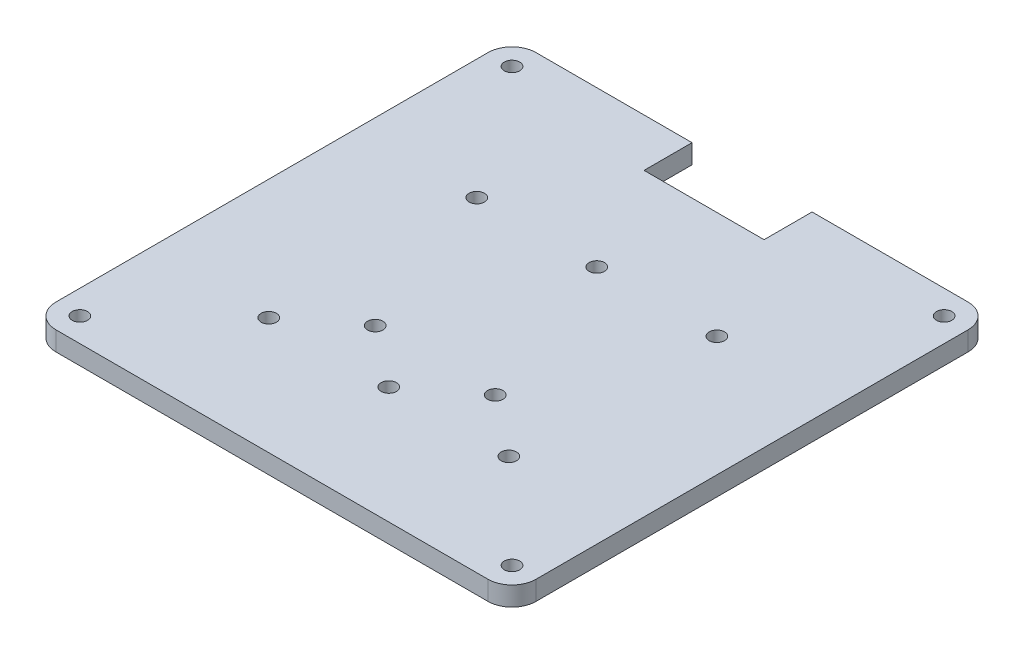
ISO-10303-21;
HEADER;
FILE_DESCRIPTION(('STEP AP214'),'2;1');
FILE_NAME('part.step','',(''),(''),'','','');
FILE_SCHEMA(('AUTOMOTIVE_DESIGN { 1 0 10303 214 1 1 1 1 }'));
ENDSEC;
DATA;
#1=APPLICATION_CONTEXT('core data for automotive mechanical design processes');
#2=APPLICATION_PROTOCOL_DEFINITION('international standard','automotive_design',2000,#1);
#3=PRODUCT_CONTEXT('',#1,'mechanical');
#4=PRODUCT('Part','Part','',(#3));
#5=PRODUCT_RELATED_PRODUCT_CATEGORY('part','',(#4));
#6=PRODUCT_DEFINITION_FORMATION('','',#4);
#7=PRODUCT_DEFINITION_CONTEXT('part definition',#1,'design');
#8=PRODUCT_DEFINITION('design','',#6,#7);
#9=PRODUCT_DEFINITION_SHAPE('','',#8);
#10=(LENGTH_UNIT() NAMED_UNIT(*) SI_UNIT(.MILLI.,.METRE.));
#11=(NAMED_UNIT(*) PLANE_ANGLE_UNIT() SI_UNIT($,.RADIAN.));
#12=(NAMED_UNIT(*) SI_UNIT($,.STERADIAN.) SOLID_ANGLE_UNIT());
#13=UNCERTAINTY_MEASURE_WITH_UNIT(LENGTH_MEASURE(1.E-05),#10,'distance_accuracy_value','');
#14=(GEOMETRIC_REPRESENTATION_CONTEXT(3) GLOBAL_UNCERTAINTY_ASSIGNED_CONTEXT((#13)) GLOBAL_UNIT_ASSIGNED_CONTEXT((#10,
#11,#12)) REPRESENTATION_CONTEXT('',''));
#15=CARTESIAN_POINT('',(0.,0.,0.));
#16=DIRECTION('',(0.,0.,1.));
#17=DIRECTION('',(1.,0.,0.));
#18=AXIS2_PLACEMENT_3D('',#15,#16,#17);
#19=CARTESIAN_POINT('',(0.,4.,-40.));
#20=DIRECTION('',(0.,0.,1.));
#21=DIRECTION('',(1.,0.,0.));
#22=AXIS2_PLACEMENT_3D('',#19,#20,#21);
#23=PLANE('',#22);
#24=DIRECTION('',(-1.,0.,0.));
#25=VECTOR('',#24,1.);
#26=CARTESIAN_POINT('',(0.,0.,-40.));
#27=LINE('',#26,#25);
#28=CARTESIAN_POINT('',(12.5,0.,-40.));
#29=VERTEX_POINT('',#28);
#30=CARTESIAN_POINT('',(-12.5,0.,-40.));
#31=VERTEX_POINT('',#30);
#32=EDGE_CURVE('E148',#29,#31,#27,.T.);
#33=ORIENTED_EDGE('',*,*,#32,.T.);
#34=DIRECTION('',(0.,-1.,0.));
#35=VECTOR('',#34,1.);
#36=CARTESIAN_POINT('',(-12.5,4.,-40.));
#37=LINE('',#36,#35);
#38=CARTESIAN_POINT('',(-12.5,4.,-40.));
#39=VERTEX_POINT('',#38);
#40=EDGE_CURVE('E129',#39,#31,#37,.T.);
#41=ORIENTED_EDGE('',*,*,#40,.F.);
#42=DIRECTION('',(-1.,0.,0.));
#43=VECTOR('',#42,1.);
#44=CARTESIAN_POINT('',(0.,4.,-40.));
#45=LINE('',#44,#43);
#46=CARTESIAN_POINT('',(12.5,4.,-40.));
#47=VERTEX_POINT('',#46);
#48=EDGE_CURVE('E136',#47,#39,#45,.T.);
#49=ORIENTED_EDGE('',*,*,#48,.F.);
#50=DIRECTION('',(0.,-1.,0.));
#51=VECTOR('',#50,1.);
#52=CARTESIAN_POINT('',(12.5,4.,-40.));
#53=LINE('',#52,#51);
#54=EDGE_CURVE('E235',#47,#29,#53,.T.);
#55=ORIENTED_EDGE('',*,*,#54,.T.);
#56=EDGE_LOOP('',(#33,#41,#49,#55));
#57=FACE_BOUND('',#56,.T.);
#58=ADVANCED_FACE('F35',(#57),#23,.F.);
#59=CARTESIAN_POINT('',(-12.5,4.,0.));
#60=DIRECTION('',(-1.,0.,0.));
#61=DIRECTION('',(0.,0.,1.));
#62=AXIS2_PLACEMENT_3D('',#59,#60,#61);
#63=PLANE('',#62);
#64=DIRECTION('',(0.,0.,-1.));
#65=VECTOR('',#64,1.);
#66=CARTESIAN_POINT('',(-12.5,0.,0.));
#67=LINE('',#66,#65);
#68=CARTESIAN_POINT('',(-12.5,0.,-50.));
#69=VERTEX_POINT('',#68);
#70=EDGE_CURVE('E245',#31,#69,#67,.T.);
#71=ORIENTED_EDGE('',*,*,#70,.T.);
#72=DIRECTION('',(0.,-1.,0.));
#73=VECTOR('',#72,1.);
#74=CARTESIAN_POINT('',(-12.5,4.,-50.));
#75=LINE('',#74,#73);
#76=CARTESIAN_POINT('',(-12.5,4.,-50.));
#77=VERTEX_POINT('',#76);
#78=EDGE_CURVE('E132',#77,#69,#75,.T.);
#79=ORIENTED_EDGE('',*,*,#78,.F.);
#80=DIRECTION('',(0.,0.,-1.));
#81=VECTOR('',#80,1.);
#82=CARTESIAN_POINT('',(-12.5,4.,0.));
#83=LINE('',#82,#81);
#84=EDGE_CURVE('E125',#39,#77,#83,.T.);
#85=ORIENTED_EDGE('',*,*,#84,.F.);
#86=ORIENTED_EDGE('',*,*,#40,.T.);
#87=EDGE_LOOP('',(#71,#79,#85,#86));
#88=FACE_BOUND('',#87,.T.);
#89=ADVANCED_FACE('F127',(#88),#63,.F.);
#90=CARTESIAN_POINT('',(0.,4.,-50.));
#91=DIRECTION('',(0.,0.,1.));
#92=DIRECTION('',(1.,0.,0.));
#93=AXIS2_PLACEMENT_3D('',#90,#91,#92);
#94=PLANE('',#93);
#95=DIRECTION('',(-1.,0.,0.));
#96=VECTOR('',#95,1.);
#97=CARTESIAN_POINT('',(0.,0.,-50.));
#98=LINE('',#97,#96);
#99=CARTESIAN_POINT('',(-45.,0.,-50.));
#100=VERTEX_POINT('',#99);
#101=EDGE_CURVE('E206',#69,#100,#98,.T.);
#102=ORIENTED_EDGE('',*,*,#101,.T.);
#103=DIRECTION('',(0.,-1.,0.));
#104=VECTOR('',#103,1.);
#105=CARTESIAN_POINT('',(-45.,4.,-50.));
#106=LINE('',#105,#104);
#107=CARTESIAN_POINT('',(-45.,4.,-50.));
#108=VERTEX_POINT('',#107);
#109=EDGE_CURVE('E167',#100,#108,#106,.F.);
#110=ORIENTED_EDGE('',*,*,#109,.T.);
#111=DIRECTION('',(-1.,0.,0.));
#112=VECTOR('',#111,1.);
#113=CARTESIAN_POINT('',(0.,4.,-50.));
#114=LINE('',#113,#112);
#115=EDGE_CURVE('E135',#77,#108,#114,.T.);
#116=ORIENTED_EDGE('',*,*,#115,.F.);
#117=ORIENTED_EDGE('',*,*,#78,.T.);
#118=EDGE_LOOP('',(#102,#110,#116,#117));
#119=FACE_BOUND('',#118,.T.);
#120=ADVANCED_FACE('F330',(#119),#94,.F.);
#121=CARTESIAN_POINT('',(-50.,4.,0.));
#122=DIRECTION('',(-1.,0.,0.));
#123=DIRECTION('',(0.,0.,1.));
#124=AXIS2_PLACEMENT_3D('',#121,#122,#123);
#125=PLANE('',#124);
#126=DIRECTION('',(0.,0.,-1.));
#127=VECTOR('',#126,1.);
#128=CARTESIAN_POINT('',(-50.,4.,0.));
#129=LINE('',#128,#127);
#130=CARTESIAN_POINT('',(-50.,4.,45.));
#131=VERTEX_POINT('',#130);
#132=CARTESIAN_POINT('',(-50.,4.,-45.));
#133=VERTEX_POINT('',#132);
#134=EDGE_CURVE('E268',#131,#133,#129,.T.);
#135=ORIENTED_EDGE('',*,*,#134,.T.);
#136=DIRECTION('',(0.,-1.,0.));
#137=VECTOR('',#136,1.);
#138=CARTESIAN_POINT('',(-50.,0.,-45.));
#139=LINE('',#138,#137);
#140=CARTESIAN_POINT('',(-50.,0.,-45.));
#141=VERTEX_POINT('',#140);
#142=EDGE_CURVE('E151',#133,#141,#139,.T.);
#143=ORIENTED_EDGE('',*,*,#142,.T.);
#144=DIRECTION('',(0.,0.,-1.));
#145=VECTOR('',#144,1.);
#146=CARTESIAN_POINT('',(-50.,0.,0.));
#147=LINE('',#146,#145);
#148=CARTESIAN_POINT('',(-50.,0.,45.));
#149=VERTEX_POINT('',#148);
#150=EDGE_CURVE('E202',#149,#141,#147,.T.);
#151=ORIENTED_EDGE('',*,*,#150,.F.);
#152=DIRECTION('',(0.,-1.,0.));
#153=VECTOR('',#152,1.);
#154=CARTESIAN_POINT('',(-50.,4.,45.));
#155=LINE('',#154,#153);
#156=EDGE_CURVE('E149',#149,#131,#155,.F.);
#157=ORIENTED_EDGE('',*,*,#156,.T.);
#158=EDGE_LOOP('',(#135,#143,#151,#157));
#159=FACE_BOUND('',#158,.T.);
#160=ADVANCED_FACE('F333',(#159),#125,.T.);
#161=CARTESIAN_POINT('',(0.,4.,50.));
#162=DIRECTION('',(0.,0.,1.));
#163=DIRECTION('',(1.,0.,0.));
#164=AXIS2_PLACEMENT_3D('',#161,#162,#163);
#165=PLANE('',#164);
#166=DIRECTION('',(-1.,0.,0.));
#167=VECTOR('',#166,1.);
#168=CARTESIAN_POINT('',(0.,0.,50.));
#169=LINE('',#168,#167);
#170=CARTESIAN_POINT('',(45.,0.,50.));
#171=VERTEX_POINT('',#170);
#172=CARTESIAN_POINT('',(-45.,0.,50.));
#173=VERTEX_POINT('',#172);
#174=EDGE_CURVE('E189',#171,#173,#169,.T.);
#175=ORIENTED_EDGE('',*,*,#174,.F.);
#176=DIRECTION('',(0.,-1.,0.));
#177=VECTOR('',#176,1.);
#178=CARTESIAN_POINT('',(45.,4.,50.));
#179=LINE('',#178,#177);
#180=CARTESIAN_POINT('',(45.,4.,50.));
#181=VERTEX_POINT('',#180);
#182=EDGE_CURVE('E11',#171,#181,#179,.F.);
#183=ORIENTED_EDGE('',*,*,#182,.T.);
#184=DIRECTION('',(-1.,0.,0.));
#185=VECTOR('',#184,1.);
#186=CARTESIAN_POINT('',(0.,4.,50.));
#187=LINE('',#186,#185);
#188=CARTESIAN_POINT('',(-45.,4.,50.));
#189=VERTEX_POINT('',#188);
#190=EDGE_CURVE('E192',#181,#189,#187,.T.);
#191=ORIENTED_EDGE('',*,*,#190,.T.);
#192=DIRECTION('',(0.,-1.,0.));
#193=VECTOR('',#192,1.);
#194=CARTESIAN_POINT('',(-45.,4.,50.));
#195=LINE('',#194,#193);
#196=EDGE_CURVE('E43',#189,#173,#195,.T.);
#197=ORIENTED_EDGE('',*,*,#196,.T.);
#198=EDGE_LOOP('',(#175,#183,#191,#197));
#199=FACE_BOUND('',#198,.T.);
#200=ADVANCED_FACE('F188',(#199),#165,.T.);
#201=CARTESIAN_POINT('',(50.,4.,0.));
#202=DIRECTION('',(-1.,0.,0.));
#203=DIRECTION('',(0.,0.,1.));
#204=AXIS2_PLACEMENT_3D('',#201,#202,#203);
#205=PLANE('',#204);
#206=DIRECTION('',(0.,0.,-1.));
#207=VECTOR('',#206,1.);
#208=CARTESIAN_POINT('',(50.,0.,0.));
#209=LINE('',#208,#207);
#210=CARTESIAN_POINT('',(50.,0.,45.));
#211=VERTEX_POINT('',#210);
#212=CARTESIAN_POINT('',(50.,0.,-45.));
#213=VERTEX_POINT('',#212);
#214=EDGE_CURVE('E201',#211,#213,#209,.T.);
#215=ORIENTED_EDGE('',*,*,#214,.T.);
#216=DIRECTION('',(0.,-1.,0.));
#217=VECTOR('',#216,1.);
#218=CARTESIAN_POINT('',(50.,4.,-45.));
#219=LINE('',#218,#217);
#220=CARTESIAN_POINT('',(50.,4.,-45.));
#221=VERTEX_POINT('',#220);
#222=EDGE_CURVE('E58',#213,#221,#219,.F.);
#223=ORIENTED_EDGE('',*,*,#222,.T.);
#224=DIRECTION('',(0.,0.,-1.));
#225=VECTOR('',#224,1.);
#226=CARTESIAN_POINT('',(50.,4.,0.));
#227=LINE('',#226,#225);
#228=CARTESIAN_POINT('',(50.,4.,45.));
#229=VERTEX_POINT('',#228);
#230=EDGE_CURVE('E263',#229,#221,#227,.T.);
#231=ORIENTED_EDGE('',*,*,#230,.F.);
#232=DIRECTION('',(0.,-1.,0.));
#233=VECTOR('',#232,1.);
#234=CARTESIAN_POINT('',(50.,0.,45.));
#235=LINE('',#234,#233);
#236=EDGE_CURVE('E179',#229,#211,#235,.T.);
#237=ORIENTED_EDGE('',*,*,#236,.T.);
#238=EDGE_LOOP('',(#215,#223,#231,#237));
#239=FACE_BOUND('',#238,.T.);
#240=ADVANCED_FACE('F261',(#239),#205,.F.);
#241=CARTESIAN_POINT('',(45.,4.,-50.));
#242=VERTEX_POINT('',#241);
#243=CARTESIAN_POINT('',(12.5,4.,-50.));
#244=VERTEX_POINT('',#243);
#245=EDGE_CURVE('E258',#242,#244,#114,.T.);
#246=ORIENTED_EDGE('',*,*,#245,.F.);
#247=DIRECTION('',(0.,-1.,0.));
#248=VECTOR('',#247,1.);
#249=CARTESIAN_POINT('',(45.,4.,-50.));
#250=LINE('',#249,#248);
#251=CARTESIAN_POINT('',(45.,0.,-50.));
#252=VERTEX_POINT('',#251);
#253=EDGE_CURVE('E176',#242,#252,#250,.T.);
#254=ORIENTED_EDGE('',*,*,#253,.T.);
#255=CARTESIAN_POINT('',(12.5,0.,-50.));
#256=VERTEX_POINT('',#255);
#257=EDGE_CURVE('E204',#252,#256,#98,.T.);
#258=ORIENTED_EDGE('',*,*,#257,.T.);
#259=DIRECTION('',(0.,-1.,0.));
#260=VECTOR('',#259,1.);
#261=CARTESIAN_POINT('',(12.5,4.,-50.));
#262=LINE('',#261,#260);
#263=EDGE_CURVE('E153',#244,#256,#262,.T.);
#264=ORIENTED_EDGE('',*,*,#263,.F.);
#265=EDGE_LOOP('',(#246,#254,#258,#264));
#266=FACE_BOUND('',#265,.T.);
#267=ADVANCED_FACE('F256',(#266),#94,.F.);
#268=CARTESIAN_POINT('',(-12.5,4.,16.));
#269=DIRECTION('',(0.,-1.,0.));
#270=DIRECTION('',(0.,0.,-1.));
#271=AXIS2_PLACEMENT_3D('',#268,#269,#270);
#272=CYLINDRICAL_SURFACE('',#271,1.6);
#273=CARTESIAN_POINT('',(-12.5,4.,16.));
#274=DIRECTION('',(0.,1.,0.));
#275=DIRECTION('',(0.,0.,1.));
#276=AXIS2_PLACEMENT_3D('',#273,#274,#275);
#277=CIRCLE('',#276,1.6);
#278=CARTESIAN_POINT('',(-12.5,4.,17.6));
#279=VERTEX_POINT('',#278);
#280=EDGE_CURVE('E291',#279,#279,#277,.F.);
#281=ORIENTED_EDGE('',*,*,#280,.F.);
#282=EDGE_LOOP('',(#281));
#283=FACE_BOUND('',#282,.T.);
#284=CARTESIAN_POINT('',(-12.5,0.,16.));
#285=DIRECTION('',(0.,1.,0.));
#286=DIRECTION('',(0.,0.,1.));
#287=AXIS2_PLACEMENT_3D('',#284,#285,#286);
#288=CIRCLE('',#287,1.6);
#289=CARTESIAN_POINT('',(-12.5,0.,17.6));
#290=VERTEX_POINT('',#289);
#291=EDGE_CURVE('E228',#290,#290,#288,.F.);
#292=ORIENTED_EDGE('',*,*,#291,.T.);
#293=EDGE_LOOP('',(#292));
#294=FACE_BOUND('',#293,.T.);
#295=ADVANCED_FACE('F343',(#283,#294),#272,.F.);
#296=CARTESIAN_POINT('',(12.5,4.,16.));
#297=DIRECTION('',(0.,-1.,0.));
#298=DIRECTION('',(0.,0.,-1.));
#299=AXIS2_PLACEMENT_3D('',#296,#297,#298);
#300=CYLINDRICAL_SURFACE('',#299,1.6);
#301=CARTESIAN_POINT('',(12.5,4.,16.));
#302=DIRECTION('',(0.,1.,0.));
#303=DIRECTION('',(0.,0.,1.));
#304=AXIS2_PLACEMENT_3D('',#301,#302,#303);
#305=CIRCLE('',#304,1.6);
#306=CARTESIAN_POINT('',(12.5,4.,17.6));
#307=VERTEX_POINT('',#306);
#308=EDGE_CURVE('E288',#307,#307,#305,.T.);
#309=ORIENTED_EDGE('',*,*,#308,.T.);
#310=EDGE_LOOP('',(#309));
#311=FACE_BOUND('',#310,.T.);
#312=CARTESIAN_POINT('',(12.5,0.,16.));
#313=DIRECTION('',(0.,1.,0.));
#314=DIRECTION('',(0.,0.,1.));
#315=AXIS2_PLACEMENT_3D('',#312,#313,#314);
#316=CIRCLE('',#315,1.6);
#317=CARTESIAN_POINT('',(12.5,0.,17.6));
#318=VERTEX_POINT('',#317);
#319=EDGE_CURVE('E225',#318,#318,#316,.T.);
#320=ORIENTED_EDGE('',*,*,#319,.F.);
#321=EDGE_LOOP('',(#320));
#322=FACE_BOUND('',#321,.T.);
#323=ADVANCED_FACE('F361',(#311,#322),#300,.F.);
#324=CARTESIAN_POINT('',(-45.,4.,45.));
#325=DIRECTION('',(0.,-1.,0.));
#326=DIRECTION('',(0.,0.,-1.));
#327=AXIS2_PLACEMENT_3D('',#324,#325,#326);
#328=CYLINDRICAL_SURFACE('',#327,1.6);
#329=CARTESIAN_POINT('',(-45.,4.,45.));
#330=DIRECTION('',(0.,1.,0.));
#331=DIRECTION('',(0.,0.,1.));
#332=AXIS2_PLACEMENT_3D('',#329,#330,#331);
#333=CIRCLE('',#332,1.6);
#334=CARTESIAN_POINT('',(-45.,4.,46.6));
#335=VERTEX_POINT('',#334);
#336=EDGE_CURVE('E285',#335,#335,#333,.T.);
#337=ORIENTED_EDGE('',*,*,#336,.T.);
#338=EDGE_LOOP('',(#337));
#339=FACE_BOUND('',#338,.T.);
#340=CARTESIAN_POINT('',(-45.,0.,45.));
#341=DIRECTION('',(0.,1.,0.));
#342=DIRECTION('',(0.,0.,1.));
#343=AXIS2_PLACEMENT_3D('',#340,#341,#342);
#344=CIRCLE('',#343,1.6);
#345=CARTESIAN_POINT('',(-45.,0.,46.6));
#346=VERTEX_POINT('',#345);
#347=EDGE_CURVE('E222',#346,#346,#344,.T.);
#348=ORIENTED_EDGE('',*,*,#347,.F.);
#349=EDGE_LOOP('',(#348));
#350=FACE_BOUND('',#349,.T.);
#351=ADVANCED_FACE('F357',(#339,#350),#328,.F.);
#352=CARTESIAN_POINT('',(45.,4.,45.));
#353=DIRECTION('',(0.,-1.,0.));
#354=DIRECTION('',(0.,0.,-1.));
#355=AXIS2_PLACEMENT_3D('',#352,#353,#354);
#356=CYLINDRICAL_SURFACE('',#355,1.6);
#357=CARTESIAN_POINT('',(45.,4.,45.));
#358=DIRECTION('',(0.,1.,0.));
#359=DIRECTION('',(0.,0.,1.));
#360=AXIS2_PLACEMENT_3D('',#357,#358,#359);
#361=CIRCLE('',#360,1.6);
#362=CARTESIAN_POINT('',(45.,4.,46.6));
#363=VERTEX_POINT('',#362);
#364=EDGE_CURVE('E282',#363,#363,#361,.T.);
#365=ORIENTED_EDGE('',*,*,#364,.T.);
#366=EDGE_LOOP('',(#365));
#367=FACE_BOUND('',#366,.T.);
#368=CARTESIAN_POINT('',(45.,0.,45.));
#369=DIRECTION('',(0.,1.,0.));
#370=DIRECTION('',(0.,0.,1.));
#371=AXIS2_PLACEMENT_3D('',#368,#369,#370);
#372=CIRCLE('',#371,1.6);
#373=CARTESIAN_POINT('',(45.,0.,46.6));
#374=VERTEX_POINT('',#373);
#375=EDGE_CURVE('E219',#374,#374,#372,.T.);
#376=ORIENTED_EDGE('',*,*,#375,.F.);
#377=EDGE_LOOP('',(#376));
#378=FACE_BOUND('',#377,.T.);
#379=ADVANCED_FACE('F353',(#367,#378),#356,.F.);
#380=CARTESIAN_POINT('',(45.,4.,-45.));
#381=DIRECTION('',(0.,-1.,0.));
#382=DIRECTION('',(0.,0.,-1.));
#383=AXIS2_PLACEMENT_3D('',#380,#381,#382);
#384=CYLINDRICAL_SURFACE('',#383,1.6);
#385=CARTESIAN_POINT('',(45.,4.,-45.));
#386=DIRECTION('',(0.,1.,0.));
#387=DIRECTION('',(0.,0.,1.));
#388=AXIS2_PLACEMENT_3D('',#385,#386,#387);
#389=CIRCLE('',#388,1.6);
#390=CARTESIAN_POINT('',(45.,4.,-43.4));
#391=VERTEX_POINT('',#390);
#392=EDGE_CURVE('E279',#391,#391,#389,.T.);
#393=ORIENTED_EDGE('',*,*,#392,.T.);
#394=EDGE_LOOP('',(#393));
#395=FACE_BOUND('',#394,.T.);
#396=CARTESIAN_POINT('',(45.,0.,-45.));
#397=DIRECTION('',(0.,1.,0.));
#398=DIRECTION('',(0.,0.,1.));
#399=AXIS2_PLACEMENT_3D('',#396,#397,#398);
#400=CIRCLE('',#399,1.6);
#401=CARTESIAN_POINT('',(45.,0.,-43.4));
#402=VERTEX_POINT('',#401);
#403=EDGE_CURVE('E216',#402,#402,#400,.T.);
#404=ORIENTED_EDGE('',*,*,#403,.F.);
#405=EDGE_LOOP('',(#404));
#406=FACE_BOUND('',#405,.T.);
#407=ADVANCED_FACE('F349',(#395,#406),#384,.F.);
#408=CARTESIAN_POINT('',(-45.,4.,-45.));
#409=DIRECTION('',(0.,-1.,0.));
#410=DIRECTION('',(0.,0.,-1.));
#411=AXIS2_PLACEMENT_3D('',#408,#409,#410);
#412=CYLINDRICAL_SURFACE('',#411,1.6);
#413=CARTESIAN_POINT('',(-45.,4.,-45.));
#414=DIRECTION('',(0.,1.,0.));
#415=DIRECTION('',(0.,0.,1.));
#416=AXIS2_PLACEMENT_3D('',#413,#414,#415);
#417=CIRCLE('',#416,1.6);
#418=CARTESIAN_POINT('',(-45.,4.,-43.4));
#419=VERTEX_POINT('',#418);
#420=EDGE_CURVE('E276',#419,#419,#417,.T.);
#421=ORIENTED_EDGE('',*,*,#420,.T.);
#422=EDGE_LOOP('',(#421));
#423=FACE_BOUND('',#422,.T.);
#424=CARTESIAN_POINT('',(-45.,0.,-45.));
#425=DIRECTION('',(0.,1.,0.));
#426=DIRECTION('',(0.,0.,1.));
#427=AXIS2_PLACEMENT_3D('',#424,#425,#426);
#428=CIRCLE('',#427,1.6);
#429=CARTESIAN_POINT('',(-45.,0.,-43.4));
#430=VERTEX_POINT('',#429);
#431=EDGE_CURVE('E213',#430,#430,#428,.T.);
#432=ORIENTED_EDGE('',*,*,#431,.F.);
#433=EDGE_LOOP('',(#432));
#434=FACE_BOUND('',#433,.T.);
#435=ADVANCED_FACE('F346',(#423,#434),#412,.F.);
#436=CARTESIAN_POINT('',(12.5,4.,0.));
#437=DIRECTION('',(-1.,0.,0.));
#438=DIRECTION('',(0.,0.,1.));
#439=AXIS2_PLACEMENT_3D('',#436,#437,#438);
#440=PLANE('',#439);
#441=DIRECTION('',(0.,0.,-1.));
#442=VECTOR('',#441,1.);
#443=CARTESIAN_POINT('',(12.5,0.,0.));
#444=LINE('',#443,#442);
#445=EDGE_CURVE('E210',#29,#256,#444,.T.);
#446=ORIENTED_EDGE('',*,*,#445,.F.);
#447=ORIENTED_EDGE('',*,*,#54,.F.);
#448=DIRECTION('',(0.,0.,-1.));
#449=VECTOR('',#448,1.);
#450=CARTESIAN_POINT('',(12.5,4.,0.));
#451=LINE('',#450,#449);
#452=EDGE_CURVE('E143',#47,#244,#451,.T.);
#453=ORIENTED_EDGE('',*,*,#452,.T.);
#454=ORIENTED_EDGE('',*,*,#263,.T.);
#455=EDGE_LOOP('',(#446,#447,#453,#454));
#456=FACE_BOUND('',#455,.T.);
#457=ADVANCED_FACE('F241',(#456),#440,.T.);
#458=CARTESIAN_POINT('',(0.,4.,25.66));
#459=DIRECTION('',(0.,-1.,0.));
#460=DIRECTION('',(0.,0.,-1.));
#461=AXIS2_PLACEMENT_3D('',#458,#459,#460);
#462=CYLINDRICAL_SURFACE('',#461,1.6);
#463=CARTESIAN_POINT('',(0.,4.,25.66));
#464=DIRECTION('',(0.,1.,0.));
#465=DIRECTION('',(0.,0.,1.));
#466=AXIS2_PLACEMENT_3D('',#463,#464,#465);
#467=CIRCLE('',#466,1.6);
#468=CARTESIAN_POINT('',(0.,4.,27.26));
#469=VERTEX_POINT('',#468);
#470=EDGE_CURVE('E145',#469,#469,#467,.T.);
#471=ORIENTED_EDGE('',*,*,#470,.T.);
#472=EDGE_LOOP('',(#471));
#473=FACE_BOUND('',#472,.T.);
#474=CARTESIAN_POINT('',(0.,0.,25.66));
#475=DIRECTION('',(0.,1.,0.));
#476=DIRECTION('',(0.,0.,1.));
#477=AXIS2_PLACEMENT_3D('',#474,#475,#476);
#478=CIRCLE('',#477,1.6);
#479=CARTESIAN_POINT('',(0.,0.,27.26));
#480=VERTEX_POINT('',#479);
#481=EDGE_CURVE('E246',#480,#480,#478,.T.);
#482=ORIENTED_EDGE('',*,*,#481,.F.);
#483=EDGE_LOOP('',(#482));
#484=FACE_BOUND('',#483,.T.);
#485=ADVANCED_FACE('F312',(#473,#484),#462,.F.);
#486=CARTESIAN_POINT('',(25.,4.,25.66));
#487=DIRECTION('',(0.,-1.,0.));
#488=DIRECTION('',(0.,0.,-1.));
#489=AXIS2_PLACEMENT_3D('',#486,#487,#488);
#490=CYLINDRICAL_SURFACE('',#489,1.6);
#491=CARTESIAN_POINT('',(25.,4.,25.66));
#492=DIRECTION('',(0.,1.,0.));
#493=DIRECTION('',(0.,0.,1.));
#494=AXIS2_PLACEMENT_3D('',#491,#492,#493);
#495=CIRCLE('',#494,1.6);
#496=CARTESIAN_POINT('',(25.,4.,27.26));
#497=VERTEX_POINT('',#496);
#498=EDGE_CURVE('E395',#497,#497,#495,.T.);
#499=ORIENTED_EDGE('',*,*,#498,.T.);
#500=EDGE_LOOP('',(#499));
#501=FACE_BOUND('',#500,.T.);
#502=CARTESIAN_POINT('',(25.,0.,25.66));
#503=DIRECTION('',(0.,1.,0.));
#504=DIRECTION('',(0.,0.,1.));
#505=AXIS2_PLACEMENT_3D('',#502,#503,#504);
#506=CIRCLE('',#505,1.6);
#507=CARTESIAN_POINT('',(25.,0.,27.26));
#508=VERTEX_POINT('',#507);
#509=EDGE_CURVE('E250',#508,#508,#506,.T.);
#510=ORIENTED_EDGE('',*,*,#509,.F.);
#511=EDGE_LOOP('',(#510));
#512=FACE_BOUND('',#511,.T.);
#513=ADVANCED_FACE('F309',(#501,#512),#490,.F.);
#514=CARTESIAN_POINT('',(0.,4.,-17.66));
#515=DIRECTION('',(0.,-1.,0.));
#516=DIRECTION('',(0.,0.,-1.));
#517=AXIS2_PLACEMENT_3D('',#514,#515,#516);
#518=CYLINDRICAL_SURFACE('',#517,1.6);
#519=CARTESIAN_POINT('',(0.,4.,-17.66));
#520=DIRECTION('',(0.,1.,0.));
#521=DIRECTION('',(0.,0.,1.));
#522=AXIS2_PLACEMENT_3D('',#519,#520,#521);
#523=CIRCLE('',#522,1.6);
#524=CARTESIAN_POINT('',(0.,4.,-16.06));
#525=VERTEX_POINT('',#524);
#526=EDGE_CURVE('E392',#525,#525,#523,.T.);
#527=ORIENTED_EDGE('',*,*,#526,.T.);
#528=EDGE_LOOP('',(#527));
#529=FACE_BOUND('',#528,.T.);
#530=CARTESIAN_POINT('',(0.,0.,-17.66));
#531=DIRECTION('',(0.,1.,0.));
#532=DIRECTION('',(0.,0.,1.));
#533=AXIS2_PLACEMENT_3D('',#530,#531,#532);
#534=CIRCLE('',#533,1.6);
#535=CARTESIAN_POINT('',(0.,0.,-16.06));
#536=VERTEX_POINT('',#535);
#537=EDGE_CURVE('E302',#536,#536,#534,.T.);
#538=ORIENTED_EDGE('',*,*,#537,.F.);
#539=EDGE_LOOP('',(#538));
#540=FACE_BOUND('',#539,.T.);
#541=ADVANCED_FACE('F311',(#529,#540),#518,.F.);
#542=CARTESIAN_POINT('',(25.,4.,-17.66));
#543=DIRECTION('',(0.,-1.,0.));
#544=DIRECTION('',(0.,0.,-1.));
#545=AXIS2_PLACEMENT_3D('',#542,#543,#544);
#546=CYLINDRICAL_SURFACE('',#545,1.6);
#547=CARTESIAN_POINT('',(25.,4.,-17.66));
#548=DIRECTION('',(0.,1.,0.));
#549=DIRECTION('',(0.,0.,1.));
#550=AXIS2_PLACEMENT_3D('',#547,#548,#549);
#551=CIRCLE('',#550,1.6);
#552=CARTESIAN_POINT('',(25.,4.,-16.06));
#553=VERTEX_POINT('',#552);
#554=EDGE_CURVE('E388',#553,#553,#551,.T.);
#555=ORIENTED_EDGE('',*,*,#554,.T.);
#556=EDGE_LOOP('',(#555));
#557=FACE_BOUND('',#556,.T.);
#558=CARTESIAN_POINT('',(25.,0.,-17.66));
#559=DIRECTION('',(0.,1.,0.));
#560=DIRECTION('',(0.,0.,1.));
#561=AXIS2_PLACEMENT_3D('',#558,#559,#560);
#562=CIRCLE('',#561,1.6);
#563=CARTESIAN_POINT('',(25.,0.,-16.06));
#564=VERTEX_POINT('',#563);
#565=EDGE_CURVE('E299',#564,#564,#562,.T.);
#566=ORIENTED_EDGE('',*,*,#565,.F.);
#567=EDGE_LOOP('',(#566));
#568=FACE_BOUND('',#567,.T.);
#569=ADVANCED_FACE('F319',(#557,#568),#546,.F.);
#570=CARTESIAN_POINT('',(-25.,4.,-17.66));
#571=DIRECTION('',(0.,-1.,0.));
#572=DIRECTION('',(0.,0.,-1.));
#573=AXIS2_PLACEMENT_3D('',#570,#571,#572);
#574=CYLINDRICAL_SURFACE('',#573,1.6);
#575=CARTESIAN_POINT('',(-25.,4.,-17.66));
#576=DIRECTION('',(0.,1.,0.));
#577=DIRECTION('',(0.,0.,1.));
#578=AXIS2_PLACEMENT_3D('',#575,#576,#577);
#579=CIRCLE('',#578,1.6);
#580=CARTESIAN_POINT('',(-25.,4.,-16.06));
#581=VERTEX_POINT('',#580);
#582=EDGE_CURVE('E234',#581,#581,#579,.F.);
#583=ORIENTED_EDGE('',*,*,#582,.F.);
#584=EDGE_LOOP('',(#583));
#585=FACE_BOUND('',#584,.T.);
#586=CARTESIAN_POINT('',(-25.,0.,-17.66));
#587=DIRECTION('',(0.,1.,0.));
#588=DIRECTION('',(0.,0.,1.));
#589=AXIS2_PLACEMENT_3D('',#586,#587,#588);
#590=CIRCLE('',#589,1.6);
#591=CARTESIAN_POINT('',(-25.,0.,-16.06));
#592=VERTEX_POINT('',#591);
#593=EDGE_CURVE('E296',#592,#592,#590,.F.);
#594=ORIENTED_EDGE('',*,*,#593,.T.);
#595=EDGE_LOOP('',(#594));
#596=FACE_BOUND('',#595,.T.);
#597=ADVANCED_FACE('F372',(#585,#596),#574,.F.);
#598=CARTESIAN_POINT('',(-25.,4.,25.6599999999999));
#599=DIRECTION('',(0.,-1.,0.));
#600=DIRECTION('',(0.,0.,-1.));
#601=AXIS2_PLACEMENT_3D('',#598,#599,#600);
#602=CYLINDRICAL_SURFACE('',#601,1.6);
#603=CARTESIAN_POINT('',(-25.,4.,25.6599999999999));
#604=DIRECTION('',(0.,1.,0.));
#605=DIRECTION('',(0.,0.,1.));
#606=AXIS2_PLACEMENT_3D('',#603,#604,#605);
#607=CIRCLE('',#606,1.6);
#608=CARTESIAN_POINT('',(-25.,4.,27.2599999999999));
#609=VERTEX_POINT('',#608);
#610=EDGE_CURVE('E236',#609,#609,#607,.F.);
#611=ORIENTED_EDGE('',*,*,#610,.F.);
#612=EDGE_LOOP('',(#611));
#613=FACE_BOUND('',#612,.T.);
#614=CARTESIAN_POINT('',(-25.,0.,25.6599999999999));
#615=DIRECTION('',(0.,1.,0.));
#616=DIRECTION('',(0.,0.,1.));
#617=AXIS2_PLACEMENT_3D('',#614,#615,#616);
#618=CIRCLE('',#617,1.6);
#619=CARTESIAN_POINT('',(-25.,0.,27.2599999999999));
#620=VERTEX_POINT('',#619);
#621=EDGE_CURVE('E231',#620,#620,#618,.F.);
#622=ORIENTED_EDGE('',*,*,#621,.T.);
#623=EDGE_LOOP('',(#622));
#624=FACE_BOUND('',#623,.T.);
#625=ADVANCED_FACE('F369',(#613,#624),#602,.F.);
#626=CARTESIAN_POINT('',(0.,4.,0.));
#627=DIRECTION('',(0.,1.,0.));
#628=DIRECTION('',(0.,0.,1.));
#629=AXIS2_PLACEMENT_3D('',#626,#627,#628);
#630=PLANE('',#629);
#631=ORIENTED_EDGE('',*,*,#582,.T.);
#632=EDGE_LOOP('',(#631));
#633=FACE_BOUND('',#632,.T.);
#634=ORIENTED_EDGE('',*,*,#554,.F.);
#635=EDGE_LOOP('',(#634));
#636=FACE_BOUND('',#635,.T.);
#637=ORIENTED_EDGE('',*,*,#526,.F.);
#638=EDGE_LOOP('',(#637));
#639=FACE_BOUND('',#638,.T.);
#640=ORIENTED_EDGE('',*,*,#498,.F.);
#641=EDGE_LOOP('',(#640));
#642=FACE_BOUND('',#641,.T.);
#643=ORIENTED_EDGE('',*,*,#470,.F.);
#644=EDGE_LOOP('',(#643));
#645=FACE_BOUND('',#644,.T.);
#646=ORIENTED_EDGE('',*,*,#115,.T.);
#647=CARTESIAN_POINT('',(-45.,4.,-45.));
#648=DIRECTION('',(0.,1.,0.));
#649=DIRECTION('',(0.,0.,1.));
#650=AXIS2_PLACEMENT_3D('',#647,#648,#649);
#651=CIRCLE('',#650,5.);
#652=EDGE_CURVE('E174',#108,#133,#651,.T.);
#653=ORIENTED_EDGE('',*,*,#652,.T.);
#654=ORIENTED_EDGE('',*,*,#134,.F.);
#655=CARTESIAN_POINT('',(-45.,4.,45.));
#656=DIRECTION('',(0.,1.,0.));
#657=DIRECTION('',(0.,0.,1.));
#658=AXIS2_PLACEMENT_3D('',#655,#656,#657);
#659=CIRCLE('',#658,5.);
#660=EDGE_CURVE('E169',#131,#189,#659,.T.);
#661=ORIENTED_EDGE('',*,*,#660,.T.);
#662=ORIENTED_EDGE('',*,*,#190,.F.);
#663=CARTESIAN_POINT('',(45.,4.,45.));
#664=DIRECTION('',(0.,1.,0.));
#665=DIRECTION('',(0.,0.,1.));
#666=AXIS2_PLACEMENT_3D('',#663,#664,#665);
#667=CIRCLE('',#666,5.);
#668=EDGE_CURVE('E171',#181,#229,#667,.T.);
#669=ORIENTED_EDGE('',*,*,#668,.T.);
#670=ORIENTED_EDGE('',*,*,#230,.T.);
#671=CARTESIAN_POINT('',(45.,4.,-45.));
#672=DIRECTION('',(0.,1.,0.));
#673=DIRECTION('',(0.,0.,1.));
#674=AXIS2_PLACEMENT_3D('',#671,#672,#673);
#675=CIRCLE('',#674,5.);
#676=EDGE_CURVE('E50',#221,#242,#675,.T.);
#677=ORIENTED_EDGE('',*,*,#676,.T.);
#678=ORIENTED_EDGE('',*,*,#245,.T.);
#679=ORIENTED_EDGE('',*,*,#452,.F.);
#680=ORIENTED_EDGE('',*,*,#48,.T.);
#681=ORIENTED_EDGE('',*,*,#84,.T.);
#682=EDGE_LOOP('',(#646,#653,#654,#661,#662,#669,#670,#677,#678,#679,#680,#681));
#683=FACE_BOUND('',#682,.T.);
#684=ORIENTED_EDGE('',*,*,#420,.F.);
#685=EDGE_LOOP('',(#684));
#686=FACE_BOUND('',#685,.T.);
#687=ORIENTED_EDGE('',*,*,#392,.F.);
#688=EDGE_LOOP('',(#687));
#689=FACE_BOUND('',#688,.T.);
#690=ORIENTED_EDGE('',*,*,#364,.F.);
#691=EDGE_LOOP('',(#690));
#692=FACE_BOUND('',#691,.T.);
#693=ORIENTED_EDGE('',*,*,#336,.F.);
#694=EDGE_LOOP('',(#693));
#695=FACE_BOUND('',#694,.T.);
#696=ORIENTED_EDGE('',*,*,#308,.F.);
#697=EDGE_LOOP('',(#696));
#698=FACE_BOUND('',#697,.T.);
#699=ORIENTED_EDGE('',*,*,#280,.T.);
#700=EDGE_LOOP('',(#699));
#701=FACE_BOUND('',#700,.T.);
#702=ORIENTED_EDGE('',*,*,#610,.T.);
#703=EDGE_LOOP('',(#702));
#704=FACE_BOUND('',#703,.T.);
#705=ADVANCED_FACE('F140',(#633,#636,#639,#642,#645,#683,#686,#689,#692,#695,#698,#701,#704),
#630,.T.);
#706=CARTESIAN_POINT('',(0.,0.,0.));
#707=DIRECTION('',(0.,1.,0.));
#708=DIRECTION('',(0.,0.,1.));
#709=AXIS2_PLACEMENT_3D('',#706,#707,#708);
#710=PLANE('',#709);
#711=ORIENTED_EDGE('',*,*,#593,.F.);
#712=EDGE_LOOP('',(#711));
#713=FACE_BOUND('',#712,.T.);
#714=ORIENTED_EDGE('',*,*,#565,.T.);
#715=EDGE_LOOP('',(#714));
#716=FACE_BOUND('',#715,.T.);
#717=ORIENTED_EDGE('',*,*,#537,.T.);
#718=EDGE_LOOP('',(#717));
#719=FACE_BOUND('',#718,.T.);
#720=ORIENTED_EDGE('',*,*,#509,.T.);
#721=EDGE_LOOP('',(#720));
#722=FACE_BOUND('',#721,.T.);
#723=ORIENTED_EDGE('',*,*,#481,.T.);
#724=EDGE_LOOP('',(#723));
#725=FACE_BOUND('',#724,.T.);
#726=ORIENTED_EDGE('',*,*,#150,.T.);
#727=CARTESIAN_POINT('',(-45.,0.,-45.));
#728=DIRECTION('',(0.,1.,0.));
#729=DIRECTION('',(0.,0.,1.));
#730=AXIS2_PLACEMENT_3D('',#727,#728,#729);
#731=CIRCLE('',#730,5.);
#732=EDGE_CURVE('E165',#141,#100,#731,.F.);
#733=ORIENTED_EDGE('',*,*,#732,.T.);
#734=ORIENTED_EDGE('',*,*,#101,.F.);
#735=ORIENTED_EDGE('',*,*,#70,.F.);
#736=ORIENTED_EDGE('',*,*,#32,.F.);
#737=ORIENTED_EDGE('',*,*,#445,.T.);
#738=ORIENTED_EDGE('',*,*,#257,.F.);
#739=CARTESIAN_POINT('',(45.,0.,-45.));
#740=DIRECTION('',(0.,1.,0.));
#741=DIRECTION('',(0.,0.,1.));
#742=AXIS2_PLACEMENT_3D('',#739,#740,#741);
#743=CIRCLE('',#742,5.);
#744=EDGE_CURVE('E163',#252,#213,#743,.F.);
#745=ORIENTED_EDGE('',*,*,#744,.T.);
#746=ORIENTED_EDGE('',*,*,#214,.F.);
#747=CARTESIAN_POINT('',(45.,0.,45.));
#748=DIRECTION('',(0.,1.,0.));
#749=DIRECTION('',(0.,0.,1.));
#750=AXIS2_PLACEMENT_3D('',#747,#748,#749);
#751=CIRCLE('',#750,5.);
#752=EDGE_CURVE('E161',#211,#171,#751,.F.);
#753=ORIENTED_EDGE('',*,*,#752,.T.);
#754=ORIENTED_EDGE('',*,*,#174,.T.);
#755=CARTESIAN_POINT('',(-45.,0.,45.));
#756=DIRECTION('',(0.,1.,0.));
#757=DIRECTION('',(0.,0.,1.));
#758=AXIS2_PLACEMENT_3D('',#755,#756,#757);
#759=CIRCLE('',#758,5.);
#760=EDGE_CURVE('E159',#173,#149,#759,.F.);
#761=ORIENTED_EDGE('',*,*,#760,.T.);
#762=EDGE_LOOP('',(#726,#733,#734,#735,#736,#737,#738,#745,#746,#753,#754,#761));
#763=FACE_BOUND('',#762,.T.);
#764=ORIENTED_EDGE('',*,*,#431,.T.);
#765=EDGE_LOOP('',(#764));
#766=FACE_BOUND('',#765,.T.);
#767=ORIENTED_EDGE('',*,*,#403,.T.);
#768=EDGE_LOOP('',(#767));
#769=FACE_BOUND('',#768,.T.);
#770=ORIENTED_EDGE('',*,*,#375,.T.);
#771=EDGE_LOOP('',(#770));
#772=FACE_BOUND('',#771,.T.);
#773=ORIENTED_EDGE('',*,*,#347,.T.);
#774=EDGE_LOOP('',(#773));
#775=FACE_BOUND('',#774,.T.);
#776=ORIENTED_EDGE('',*,*,#319,.T.);
#777=EDGE_LOOP('',(#776));
#778=FACE_BOUND('',#777,.T.);
#779=ORIENTED_EDGE('',*,*,#291,.F.);
#780=EDGE_LOOP('',(#779));
#781=FACE_BOUND('',#780,.T.);
#782=ORIENTED_EDGE('',*,*,#621,.F.);
#783=EDGE_LOOP('',(#782));
#784=FACE_BOUND('',#783,.T.);
#785=ADVANCED_FACE('F197',(#713,#716,#719,#722,#725,#763,#766,#769,#772,#775,#778,#781,#784),
#710,.F.);
#786=CARTESIAN_POINT('',(-45.,4.,-45.));
#787=DIRECTION('',(0.,1.,0.));
#788=DIRECTION('',(0.,0.,1.));
#789=AXIS2_PLACEMENT_3D('',#786,#787,#788);
#790=CYLINDRICAL_SURFACE('',#789,5.);
#791=ORIENTED_EDGE('',*,*,#652,.F.);
#792=ORIENTED_EDGE('',*,*,#109,.F.);
#793=ORIENTED_EDGE('',*,*,#732,.F.);
#794=ORIENTED_EDGE('',*,*,#142,.F.);
#795=EDGE_LOOP('',(#791,#792,#793,#794));
#796=FACE_BOUND('',#795,.T.);
#797=ADVANCED_FACE('F376',(#796),#790,.T.);
#798=CARTESIAN_POINT('',(45.,4.,-45.));
#799=DIRECTION('',(0.,-1.,0.));
#800=DIRECTION('',(0.,0.,-1.));
#801=AXIS2_PLACEMENT_3D('',#798,#799,#800);
#802=CYLINDRICAL_SURFACE('',#801,5.);
#803=ORIENTED_EDGE('',*,*,#676,.F.);
#804=ORIENTED_EDGE('',*,*,#222,.F.);
#805=ORIENTED_EDGE('',*,*,#744,.F.);
#806=ORIENTED_EDGE('',*,*,#253,.F.);
#807=EDGE_LOOP('',(#803,#804,#805,#806));
#808=FACE_BOUND('',#807,.T.);
#809=ADVANCED_FACE('F260',(#808),#802,.T.);
#810=CARTESIAN_POINT('',(45.,4.,45.));
#811=DIRECTION('',(0.,1.,0.));
#812=DIRECTION('',(0.,0.,1.));
#813=AXIS2_PLACEMENT_3D('',#810,#811,#812);
#814=CYLINDRICAL_SURFACE('',#813,5.);
#815=ORIENTED_EDGE('',*,*,#668,.F.);
#816=ORIENTED_EDGE('',*,*,#182,.F.);
#817=ORIENTED_EDGE('',*,*,#752,.F.);
#818=ORIENTED_EDGE('',*,*,#236,.F.);
#819=EDGE_LOOP('',(#815,#816,#817,#818));
#820=FACE_BOUND('',#819,.T.);
#821=ADVANCED_FACE('F266',(#820),#814,.T.);
#822=CARTESIAN_POINT('',(-45.,4.,45.));
#823=DIRECTION('',(0.,-1.,0.));
#824=DIRECTION('',(0.,0.,-1.));
#825=AXIS2_PLACEMENT_3D('',#822,#823,#824);
#826=CYLINDRICAL_SURFACE('',#825,5.);
#827=ORIENTED_EDGE('',*,*,#660,.F.);
#828=ORIENTED_EDGE('',*,*,#156,.F.);
#829=ORIENTED_EDGE('',*,*,#760,.F.);
#830=ORIENTED_EDGE('',*,*,#196,.F.);
#831=EDGE_LOOP('',(#827,#828,#829,#830));
#832=FACE_BOUND('',#831,.T.);
#833=ADVANCED_FACE('F37',(#832),#826,.T.);
#834=CLOSED_SHELL('',(#58,#89,#120,#160,#200,#240,#267,#295,#323,#351,#379,#407,#435,#457,#485,
#513,#541,#569,#597,#625,#705,#785,#797,#809,#821,#833));
#835=MANIFOLD_SOLID_BREP('B2',#834);
#836=ADVANCED_BREP_SHAPE_REPRESENTATION('',(#18,#835),#14);
#837=SHAPE_DEFINITION_REPRESENTATION(#9,#836);
ENDSEC;
END-ISO-10303-21;
